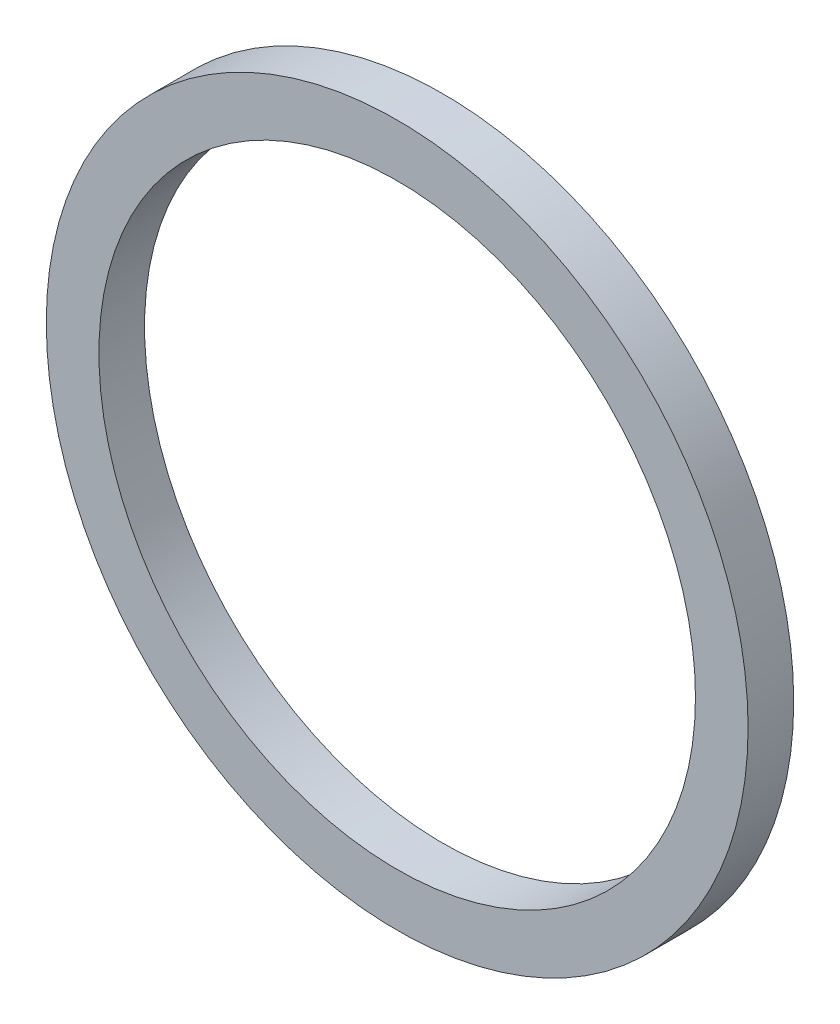
ISO-10303-21;
HEADER;
FILE_DESCRIPTION(('STEP AP214'),'2;1');
FILE_NAME('part.step','',(''),(''),'','','');
FILE_SCHEMA(('AUTOMOTIVE_DESIGN { 1 0 10303 214 1 1 1 1 }'));
ENDSEC;
DATA;
#1=APPLICATION_CONTEXT('core data for automotive mechanical design processes');
#2=APPLICATION_PROTOCOL_DEFINITION('international standard','automotive_design',2000,#1);
#3=PRODUCT_CONTEXT('',#1,'mechanical');
#4=PRODUCT('Part','Part','',(#3));
#5=PRODUCT_RELATED_PRODUCT_CATEGORY('part','',(#4));
#6=PRODUCT_DEFINITION_FORMATION('','',#4);
#7=PRODUCT_DEFINITION_CONTEXT('part definition',#1,'design');
#8=PRODUCT_DEFINITION('design','',#6,#7);
#9=PRODUCT_DEFINITION_SHAPE('','',#8);
#10=(LENGTH_UNIT() NAMED_UNIT(*) SI_UNIT(.MILLI.,.METRE.));
#11=(NAMED_UNIT(*) PLANE_ANGLE_UNIT() SI_UNIT($,.RADIAN.));
#12=(NAMED_UNIT(*) SI_UNIT($,.STERADIAN.) SOLID_ANGLE_UNIT());
#13=UNCERTAINTY_MEASURE_WITH_UNIT(LENGTH_MEASURE(1.E-05),#10,'distance_accuracy_value','');
#14=(GEOMETRIC_REPRESENTATION_CONTEXT(3) GLOBAL_UNCERTAINTY_ASSIGNED_CONTEXT((#13)) GLOBAL_UNIT_ASSIGNED_CONTEXT((#10,
#11,#12)) REPRESENTATION_CONTEXT('',''));
#15=CARTESIAN_POINT('',(0.,0.,0.));
#16=DIRECTION('',(0.,0.,1.));
#17=DIRECTION('',(1.,0.,0.));
#18=AXIS2_PLACEMENT_3D('',#15,#16,#17);
#19=CARTESIAN_POINT('',(0.,0.,1.3));
#20=DIRECTION('',(0.,0.,1.));
#21=DIRECTION('',(1.,0.,0.));
#22=AXIS2_PLACEMENT_3D('',#19,#20,#21);
#23=PLANE('',#22);
#24=CARTESIAN_POINT('',(0.,0.,1.3));
#25=DIRECTION('',(0.,0.,1.));
#26=DIRECTION('',(1.,0.,0.));
#27=AXIS2_PLACEMENT_3D('',#24,#25,#26);
#28=CIRCLE('',#27,10.);
#29=CARTESIAN_POINT('',(10.,0.,1.3));
#30=VERTEX_POINT('',#29);
#31=EDGE_CURVE('E10',#30,#30,#28,.T.);
#32=ORIENTED_EDGE('',*,*,#31,.T.);
#33=EDGE_LOOP('',(#32));
#34=FACE_BOUND('',#33,.T.);
#35=CARTESIAN_POINT('',(0.,0.,1.3));
#36=DIRECTION('',(0.,0.,1.));
#37=DIRECTION('',(1.,0.,0.));
#38=AXIS2_PLACEMENT_3D('',#35,#36,#37);
#39=CIRCLE('',#38,8.5);
#40=CARTESIAN_POINT('',(8.5,0.,1.3));
#41=VERTEX_POINT('',#40);
#42=EDGE_CURVE('E46',#41,#41,#39,.T.);
#43=ORIENTED_EDGE('',*,*,#42,.F.);
#44=EDGE_LOOP('',(#43));
#45=FACE_BOUND('',#44,.T.);
#46=ADVANCED_FACE('F35',(#34,#45),#23,.T.);
#47=CARTESIAN_POINT('',(0.,0.,0.));
#48=DIRECTION('',(0.,0.,1.));
#49=DIRECTION('',(1.,0.,0.));
#50=AXIS2_PLACEMENT_3D('',#47,#48,#49);
#51=PLANE('',#50);
#52=CARTESIAN_POINT('',(0.,0.,0.));
#53=DIRECTION('',(0.,0.,1.));
#54=DIRECTION('',(1.,0.,0.));
#55=AXIS2_PLACEMENT_3D('',#52,#53,#54);
#56=CIRCLE('',#55,10.);
#57=CARTESIAN_POINT('',(10.,0.,0.));
#58=VERTEX_POINT('',#57);
#59=EDGE_CURVE('E39',#58,#58,#56,.T.);
#60=ORIENTED_EDGE('',*,*,#59,.F.);
#61=EDGE_LOOP('',(#60));
#62=FACE_BOUND('',#61,.T.);
#63=CARTESIAN_POINT('',(0.,0.,0.));
#64=DIRECTION('',(0.,0.,1.));
#65=DIRECTION('',(1.,0.,0.));
#66=AXIS2_PLACEMENT_3D('',#63,#64,#65);
#67=CIRCLE('',#66,8.5);
#68=CARTESIAN_POINT('',(8.5,0.,0.));
#69=VERTEX_POINT('',#68);
#70=EDGE_CURVE('E48',#69,#69,#67,.T.);
#71=ORIENTED_EDGE('',*,*,#70,.T.);
#72=EDGE_LOOP('',(#71));
#73=FACE_BOUND('',#72,.T.);
#74=ADVANCED_FACE('F58',(#62,#73),#51,.F.);
#75=CARTESIAN_POINT('',(0.,0.,1.3));
#76=DIRECTION('',(0.,0.,-1.));
#77=DIRECTION('',(-1.,0.,0.));
#78=AXIS2_PLACEMENT_3D('',#75,#76,#77);
#79=CYLINDRICAL_SURFACE('',#78,10.);
#80=ORIENTED_EDGE('',*,*,#31,.F.);
#81=EDGE_LOOP('',(#80));
#82=FACE_BOUND('',#81,.T.);
#83=ORIENTED_EDGE('',*,*,#59,.T.);
#84=EDGE_LOOP('',(#83));
#85=FACE_BOUND('',#84,.T.);
#86=ADVANCED_FACE('F37',(#82,#85),#79,.T.);
#87=CARTESIAN_POINT('',(0.,0.,1.3));
#88=DIRECTION('',(0.,0.,-1.));
#89=DIRECTION('',(-1.,0.,0.));
#90=AXIS2_PLACEMENT_3D('',#87,#88,#89);
#91=CYLINDRICAL_SURFACE('',#90,8.5);
#92=ORIENTED_EDGE('',*,*,#42,.T.);
#93=EDGE_LOOP('',(#92));
#94=FACE_BOUND('',#93,.T.);
#95=ORIENTED_EDGE('',*,*,#70,.F.);
#96=EDGE_LOOP('',(#95));
#97=FACE_BOUND('',#96,.T.);
#98=ADVANCED_FACE('F54',(#94,#97),#91,.F.);
#99=CLOSED_SHELL('',(#46,#74,#86,#98));
#100=MANIFOLD_SOLID_BREP('B2',#99);
#101=ADVANCED_BREP_SHAPE_REPRESENTATION('',(#18,#100),#14);
#102=SHAPE_DEFINITION_REPRESENTATION(#9,#101);
ENDSEC;
END-ISO-10303-21;
